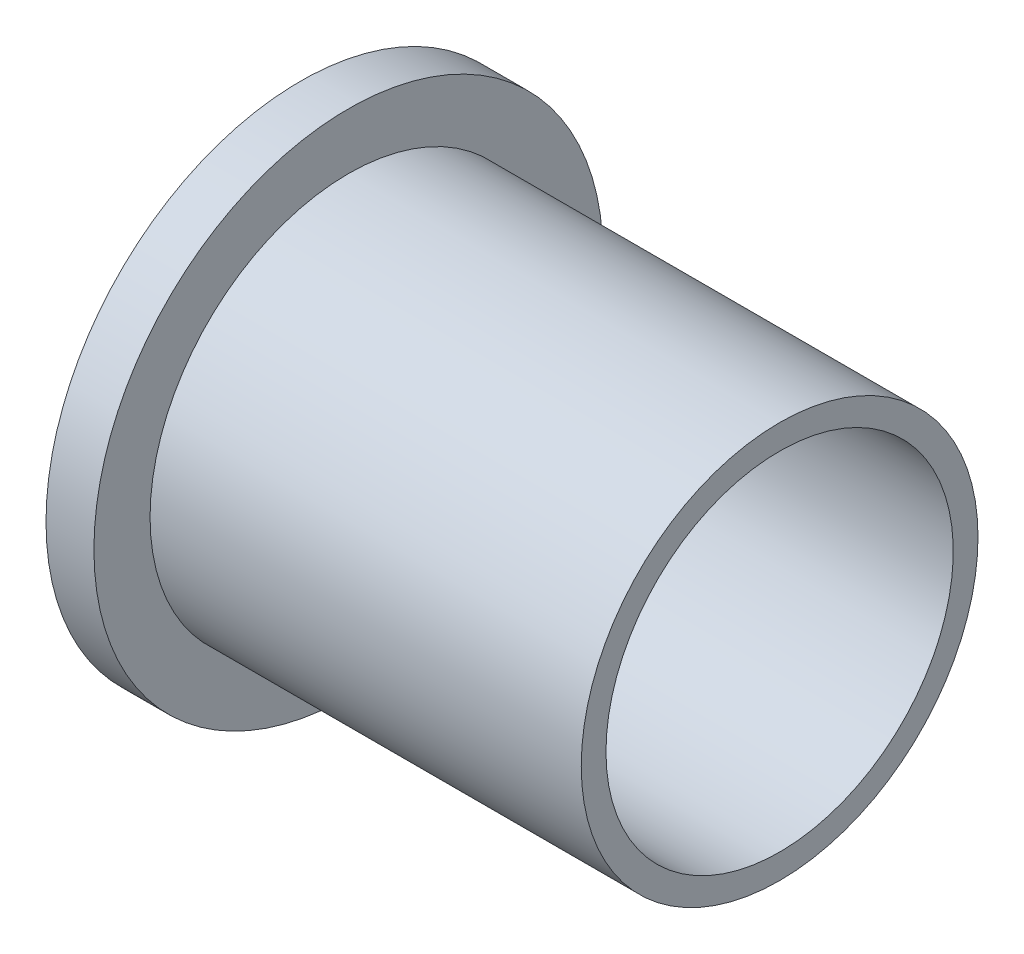
ISO-10303-21;
HEADER;
FILE_DESCRIPTION(('STEP AP214'),'2;1');
FILE_NAME('part.step','',(''),(''),'','','');
FILE_SCHEMA(('AUTOMOTIVE_DESIGN { 1 0 10303 214 1 1 1 1 }'));
ENDSEC;
DATA;
#1=APPLICATION_CONTEXT('core data for automotive mechanical design processes');
#2=APPLICATION_PROTOCOL_DEFINITION('international standard','automotive_design',2000,#1);
#3=PRODUCT_CONTEXT('',#1,'mechanical');
#4=PRODUCT('Part','Part','',(#3));
#5=PRODUCT_RELATED_PRODUCT_CATEGORY('part','',(#4));
#6=PRODUCT_DEFINITION_FORMATION('','',#4);
#7=PRODUCT_DEFINITION_CONTEXT('part definition',#1,'design');
#8=PRODUCT_DEFINITION('design','',#6,#7);
#9=PRODUCT_DEFINITION_SHAPE('','',#8);
#10=(LENGTH_UNIT() NAMED_UNIT(*) SI_UNIT(.MILLI.,.METRE.));
#11=(NAMED_UNIT(*) PLANE_ANGLE_UNIT() SI_UNIT($,.RADIAN.));
#12=(NAMED_UNIT(*) SI_UNIT($,.STERADIAN.) SOLID_ANGLE_UNIT());
#13=UNCERTAINTY_MEASURE_WITH_UNIT(LENGTH_MEASURE(1.E-05),#10,'distance_accuracy_value','');
#14=(GEOMETRIC_REPRESENTATION_CONTEXT(3) GLOBAL_UNCERTAINTY_ASSIGNED_CONTEXT((#13)) GLOBAL_UNIT_ASSIGNED_CONTEXT((#10,
#11,#12)) REPRESENTATION_CONTEXT('',''));
#15=CARTESIAN_POINT('',(0.,0.,0.));
#16=DIRECTION('',(0.,0.,1.));
#17=DIRECTION('',(1.,0.,0.));
#18=AXIS2_PLACEMENT_3D('',#15,#16,#17);
#19=CARTESIAN_POINT('',(0.,0.,0.));
#20=DIRECTION('',(-1.,0.,0.));
#21=DIRECTION('',(0.,0.,1.));
#22=AXIS2_PLACEMENT_3D('',#19,#20,#21);
#23=CYLINDRICAL_SURFACE('',#22,107.95);
#24=CARTESIAN_POINT('',(0.,0.,0.));
#25=DIRECTION('',(-1.,0.,0.));
#26=DIRECTION('',(0.,0.,1.));
#27=AXIS2_PLACEMENT_3D('',#24,#25,#26);
#28=CIRCLE('',#27,107.95);
#29=CARTESIAN_POINT('',(0.,0.,107.95));
#30=VERTEX_POINT('',#29);
#31=EDGE_CURVE('E10',#30,#30,#28,.T.);
#32=ORIENTED_EDGE('',*,*,#31,.F.);
#33=EDGE_LOOP('',(#32));
#34=FACE_BOUND('',#33,.T.);
#35=CARTESIAN_POINT('',(20.32,0.,0.));
#36=DIRECTION('',(-1.,0.,0.));
#37=DIRECTION('',(0.,0.,1.));
#38=AXIS2_PLACEMENT_3D('',#35,#36,#37);
#39=CIRCLE('',#38,107.95);
#40=CARTESIAN_POINT('',(20.32,0.,107.95));
#41=VERTEX_POINT('',#40);
#42=EDGE_CURVE('E60',#41,#41,#39,.T.);
#43=ORIENTED_EDGE('',*,*,#42,.T.);
#44=EDGE_LOOP('',(#43));
#45=FACE_BOUND('',#44,.T.);
#46=ADVANCED_FACE('F38',(#34,#45),#23,.T.);
#47=CARTESIAN_POINT('',(0.,107.95,0.));
#48=DIRECTION('',(1.,0.,0.));
#49=DIRECTION('',(0.,0.,-1.));
#50=AXIS2_PLACEMENT_3D('',#47,#48,#49);
#51=PLANE('',#50);
#52=CARTESIAN_POINT('',(0.,0.,0.));
#53=DIRECTION('',(-1.,0.,0.));
#54=DIRECTION('',(0.,0.,1.));
#55=AXIS2_PLACEMENT_3D('',#52,#53,#54);
#56=CIRCLE('',#55,73.6473);
#57=CARTESIAN_POINT('',(0.,0.,73.6473));
#58=VERTEX_POINT('',#57);
#59=EDGE_CURVE('E44',#58,#58,#56,.T.);
#60=ORIENTED_EDGE('',*,*,#59,.F.);
#61=EDGE_LOOP('',(#60));
#62=FACE_BOUND('',#61,.T.);
#63=ORIENTED_EDGE('',*,*,#31,.T.);
#64=EDGE_LOOP('',(#63));
#65=FACE_BOUND('',#64,.T.);
#66=ADVANCED_FACE('F85',(#62,#65),#51,.F.);
#67=CARTESIAN_POINT('',(0.,0.,0.));
#68=DIRECTION('',(-1.,0.,0.));
#69=DIRECTION('',(0.,0.,1.));
#70=AXIS2_PLACEMENT_3D('',#67,#68,#69);
#71=CYLINDRICAL_SURFACE('',#70,73.6473);
#72=CARTESIAN_POINT('',(203.2,0.,0.));
#73=DIRECTION('',(-1.,0.,0.));
#74=DIRECTION('',(0.,0.,1.));
#75=AXIS2_PLACEMENT_3D('',#72,#73,#74);
#76=CIRCLE('',#75,73.6473);
#77=CARTESIAN_POINT('',(203.2,0.,73.6473));
#78=VERTEX_POINT('',#77);
#79=EDGE_CURVE('E48',#78,#78,#76,.T.);
#80=ORIENTED_EDGE('',*,*,#79,.F.);
#81=EDGE_LOOP('',(#80));
#82=FACE_BOUND('',#81,.T.);
#83=ORIENTED_EDGE('',*,*,#59,.T.);
#84=EDGE_LOOP('',(#83));
#85=FACE_BOUND('',#84,.T.);
#86=ADVANCED_FACE('F80',(#82,#85),#71,.F.);
#87=CARTESIAN_POINT('',(203.2,73.6473,0.));
#88=DIRECTION('',(-1.,0.,0.));
#89=DIRECTION('',(0.,0.,1.));
#90=AXIS2_PLACEMENT_3D('',#87,#88,#89);
#91=PLANE('',#90);
#92=CARTESIAN_POINT('',(203.2,0.,0.));
#93=DIRECTION('',(-1.,0.,0.));
#94=DIRECTION('',(0.,0.,1.));
#95=AXIS2_PLACEMENT_3D('',#92,#93,#94);
#96=CIRCLE('',#95,84.1375);
#97=CARTESIAN_POINT('',(203.2,0.,84.1375));
#98=VERTEX_POINT('',#97);
#99=EDGE_CURVE('E52',#98,#98,#96,.T.);
#100=ORIENTED_EDGE('',*,*,#99,.F.);
#101=EDGE_LOOP('',(#100));
#102=FACE_BOUND('',#101,.T.);
#103=ORIENTED_EDGE('',*,*,#79,.T.);
#104=EDGE_LOOP('',(#103));
#105=FACE_BOUND('',#104,.T.);
#106=ADVANCED_FACE('F74',(#102,#105),#91,.F.);
#107=CARTESIAN_POINT('',(0.,0.,0.));
#108=DIRECTION('',(-1.,0.,0.));
#109=DIRECTION('',(0.,0.,1.));
#110=AXIS2_PLACEMENT_3D('',#107,#108,#109);
#111=CYLINDRICAL_SURFACE('',#110,84.1375);
#112=CARTESIAN_POINT('',(20.32,0.,0.));
#113=DIRECTION('',(-1.,0.,0.));
#114=DIRECTION('',(0.,0.,1.));
#115=AXIS2_PLACEMENT_3D('',#112,#113,#114);
#116=CIRCLE('',#115,84.1375);
#117=CARTESIAN_POINT('',(20.32,0.,84.1375));
#118=VERTEX_POINT('',#117);
#119=EDGE_CURVE('E57',#118,#118,#116,.T.);
#120=ORIENTED_EDGE('',*,*,#119,.F.);
#121=EDGE_LOOP('',(#120));
#122=FACE_BOUND('',#121,.T.);
#123=ORIENTED_EDGE('',*,*,#99,.T.);
#124=EDGE_LOOP('',(#123));
#125=FACE_BOUND('',#124,.T.);
#126=ADVANCED_FACE('F68',(#122,#125),#111,.T.);
#127=CARTESIAN_POINT('',(20.32,84.1375,0.));
#128=DIRECTION('',(-1.,0.,0.));
#129=DIRECTION('',(0.,0.,1.));
#130=AXIS2_PLACEMENT_3D('',#127,#128,#129);
#131=PLANE('',#130);
#132=ORIENTED_EDGE('',*,*,#42,.F.);
#133=EDGE_LOOP('',(#132));
#134=FACE_BOUND('',#133,.T.);
#135=ORIENTED_EDGE('',*,*,#119,.T.);
#136=EDGE_LOOP('',(#135));
#137=FACE_BOUND('',#136,.T.);
#138=ADVANCED_FACE('F65',(#134,#137),#131,.F.);
#139=CLOSED_SHELL('',(#46,#66,#86,#106,#126,#138));
#140=MANIFOLD_SOLID_BREP('B2',#139);
#141=ADVANCED_BREP_SHAPE_REPRESENTATION('',(#18,#140),#14);
#142=SHAPE_DEFINITION_REPRESENTATION(#9,#141);
ENDSEC;
END-ISO-10303-21;
